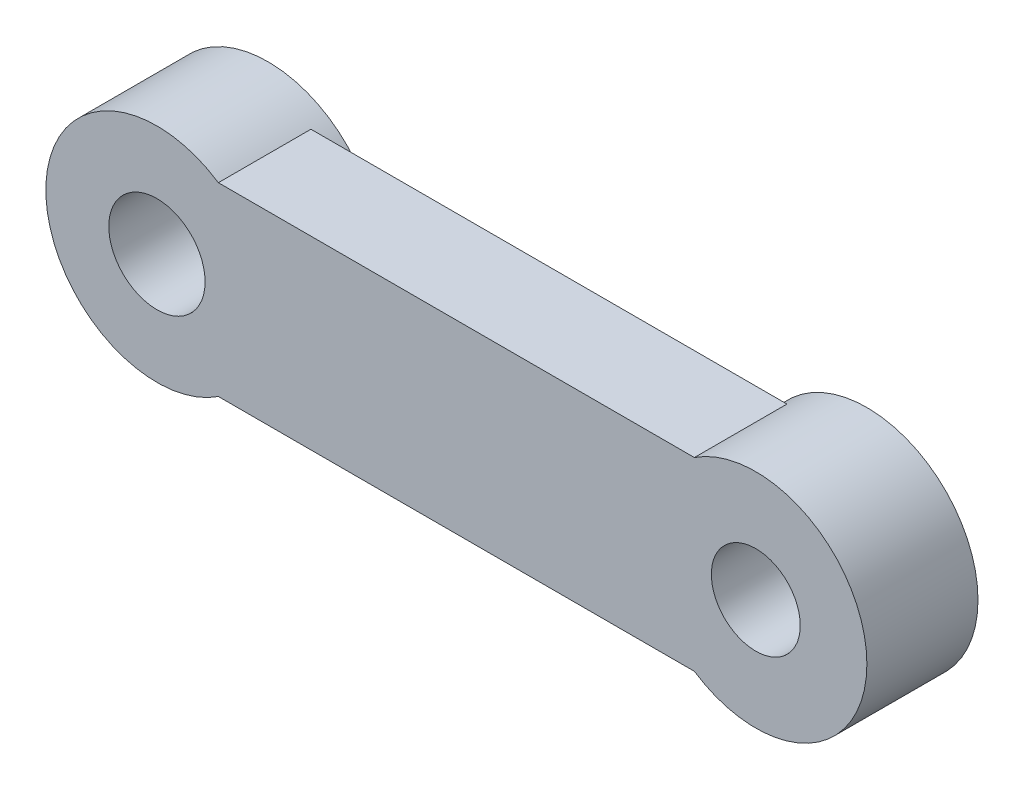
ISO-10303-21;
HEADER;
FILE_DESCRIPTION(('STEP AP214'),'2;1');
FILE_NAME('part.step','',(''),(''),'','','');
FILE_SCHEMA(('AUTOMOTIVE_DESIGN { 1 0 10303 214 1 1 1 1 }'));
ENDSEC;
DATA;
#1=APPLICATION_CONTEXT('core data for automotive mechanical design processes');
#2=APPLICATION_PROTOCOL_DEFINITION('international standard','automotive_design',2000,#1);
#3=PRODUCT_CONTEXT('',#1,'mechanical');
#4=PRODUCT('Part','Part','',(#3));
#5=PRODUCT_RELATED_PRODUCT_CATEGORY('part','',(#4));
#6=PRODUCT_DEFINITION_FORMATION('','',#4);
#7=PRODUCT_DEFINITION_CONTEXT('part definition',#1,'design');
#8=PRODUCT_DEFINITION('design','',#6,#7);
#9=PRODUCT_DEFINITION_SHAPE('','',#8);
#10=(LENGTH_UNIT() NAMED_UNIT(*) SI_UNIT(.MILLI.,.METRE.));
#11=(NAMED_UNIT(*) PLANE_ANGLE_UNIT() SI_UNIT($,.RADIAN.));
#12=(NAMED_UNIT(*) SI_UNIT($,.STERADIAN.) SOLID_ANGLE_UNIT());
#13=UNCERTAINTY_MEASURE_WITH_UNIT(LENGTH_MEASURE(1.E-05),#10,'distance_accuracy_value','');
#14=(GEOMETRIC_REPRESENTATION_CONTEXT(3) GLOBAL_UNCERTAINTY_ASSIGNED_CONTEXT((#13)) GLOBAL_UNIT_ASSIGNED_CONTEXT((#10,
#11,#12)) REPRESENTATION_CONTEXT('',''));
#15=CARTESIAN_POINT('',(0.,0.,0.));
#16=DIRECTION('',(0.,0.,1.));
#17=DIRECTION('',(1.,0.,0.));
#18=AXIS2_PLACEMENT_3D('',#15,#16,#17);
#19=CARTESIAN_POINT('',(0.,-2.5,2.5));
#20=DIRECTION('',(0.,1.,0.));
#21=DIRECTION('',(-1.,0.,0.));
#22=AXIS2_PLACEMENT_3D('',#19,#20,#21);
#23=PLANE('',#22);
#24=DIRECTION('',(1.,0.,0.));
#25=VECTOR('',#24,1.);
#26=CARTESIAN_POINT('',(0.,-2.5,2.5));
#27=LINE('',#26,#25);
#28=CARTESIAN_POINT('',(1.6583123951777,-2.5,2.5));
#29=VERTEX_POINT('',#28);
#30=CARTESIAN_POINT('',(14.5116876048223,-2.5,2.5));
#31=VERTEX_POINT('',#30);
#32=EDGE_CURVE('E101',#29,#31,#27,.T.);
#33=ORIENTED_EDGE('',*,*,#32,.F.);
#34=DIRECTION('',(0.,0.,1.));
#35=VECTOR('',#34,1.);
#36=CARTESIAN_POINT('',(1.6583123951777,-2.5,-0.5));
#37=LINE('',#36,#35);
#38=CARTESIAN_POINT('',(1.6583123951777,-2.5,0.));
#39=VERTEX_POINT('',#38);
#40=EDGE_CURVE('E80',#29,#39,#37,.F.);
#41=ORIENTED_EDGE('',*,*,#40,.T.);
#42=DIRECTION('',(1.,0.,0.));
#43=VECTOR('',#42,1.);
#44=CARTESIAN_POINT('',(0.,-2.5,0.));
#45=LINE('',#44,#43);
#46=CARTESIAN_POINT('',(14.5116876048223,-2.5,0.));
#47=VERTEX_POINT('',#46);
#48=EDGE_CURVE('E60',#39,#47,#45,.T.);
#49=ORIENTED_EDGE('',*,*,#48,.T.);
#50=DIRECTION('',(0.,0.,1.));
#51=VECTOR('',#50,1.);
#52=CARTESIAN_POINT('',(14.5116876048223,-2.5,-0.5));
#53=LINE('',#52,#51);
#54=EDGE_CURVE('E112',#47,#31,#53,.T.);
#55=ORIENTED_EDGE('',*,*,#54,.T.);
#56=EDGE_LOOP('',(#33,#41,#49,#55));
#57=FACE_BOUND('',#56,.T.);
#58=ADVANCED_FACE('F39',(#57),#23,.F.);
#59=CARTESIAN_POINT('',(0.,2.5,2.5));
#60=DIRECTION('',(0.,1.,0.));
#61=DIRECTION('',(0.,0.,1.));
#62=AXIS2_PLACEMENT_3D('',#59,#60,#61);
#63=PLANE('',#62);
#64=DIRECTION('',(0.,0.,1.));
#65=VECTOR('',#64,1.);
#66=CARTESIAN_POINT('',(1.6583123951777,2.5,-0.5));
#67=LINE('',#66,#65);
#68=CARTESIAN_POINT('',(1.6583123951777,2.5,2.5));
#69=VERTEX_POINT('',#68);
#70=CARTESIAN_POINT('',(1.6583123951777,2.5,0.));
#71=VERTEX_POINT('',#70);
#72=EDGE_CURVE('E53',#69,#71,#67,.F.);
#73=ORIENTED_EDGE('',*,*,#72,.F.);
#74=DIRECTION('',(1.,0.,0.));
#75=VECTOR('',#74,1.);
#76=CARTESIAN_POINT('',(0.,2.5,2.5));
#77=LINE('',#76,#75);
#78=CARTESIAN_POINT('',(14.5116876048223,2.5,2.5));
#79=VERTEX_POINT('',#78);
#80=EDGE_CURVE('E91',#69,#79,#77,.T.);
#81=ORIENTED_EDGE('',*,*,#80,.T.);
#82=DIRECTION('',(0.,0.,1.));
#83=VECTOR('',#82,1.);
#84=CARTESIAN_POINT('',(14.5116876048223,2.5,-0.5));
#85=LINE('',#84,#83);
#86=CARTESIAN_POINT('',(14.5116876048223,2.5,0.));
#87=VERTEX_POINT('',#86);
#88=EDGE_CURVE('E119',#87,#79,#85,.T.);
#89=ORIENTED_EDGE('',*,*,#88,.F.);
#90=DIRECTION('',(1.,0.,0.));
#91=VECTOR('',#90,1.);
#92=CARTESIAN_POINT('',(0.,2.5,0.));
#93=LINE('',#92,#91);
#94=EDGE_CURVE('E93',#71,#87,#93,.T.);
#95=ORIENTED_EDGE('',*,*,#94,.F.);
#96=EDGE_LOOP('',(#73,#81,#89,#95));
#97=FACE_BOUND('',#96,.T.);
#98=ADVANCED_FACE('F89',(#97),#63,.T.);
#99=CARTESIAN_POINT('',(0.,0.,2.5));
#100=DIRECTION('',(0.,0.,-1.));
#101=DIRECTION('',(-1.,0.,0.));
#102=AXIS2_PLACEMENT_3D('',#99,#100,#101);
#103=CYLINDRICAL_SURFACE('',#102,1.3);
#104=CARTESIAN_POINT('',(0.,0.,2.5));
#105=DIRECTION('',(0.,0.,1.));
#106=DIRECTION('',(1.,0.,0.));
#107=AXIS2_PLACEMENT_3D('',#104,#105,#106);
#108=CIRCLE('',#107,1.3);
#109=CARTESIAN_POINT('',(1.3,0.,2.5));
#110=VERTEX_POINT('',#109);
#111=EDGE_CURVE('E100',#110,#110,#108,.T.);
#112=ORIENTED_EDGE('',*,*,#111,.T.);
#113=EDGE_LOOP('',(#112));
#114=FACE_BOUND('',#113,.T.);
#115=CARTESIAN_POINT('',(0.,0.,-0.5));
#116=DIRECTION('',(0.,0.,1.));
#117=DIRECTION('',(1.,0.,0.));
#118=AXIS2_PLACEMENT_3D('',#115,#116,#117);
#119=CIRCLE('',#118,1.3);
#120=CARTESIAN_POINT('',(1.3,0.,-0.5));
#121=VERTEX_POINT('',#120);
#122=EDGE_CURVE('E84',#121,#121,#119,.T.);
#123=ORIENTED_EDGE('',*,*,#122,.F.);
#124=EDGE_LOOP('',(#123));
#125=FACE_BOUND('',#124,.T.);
#126=ADVANCED_FACE('F150',(#114,#125),#103,.F.);
#127=CARTESIAN_POINT('',(16.17,0.,2.5));
#128=DIRECTION('',(0.,0.,-1.));
#129=DIRECTION('',(-1.,0.,0.));
#130=AXIS2_PLACEMENT_3D('',#127,#128,#129);
#131=CYLINDRICAL_SURFACE('',#130,1.2);
#132=CARTESIAN_POINT('',(16.17,0.,2.5));
#133=DIRECTION('',(0.,0.,1.));
#134=DIRECTION('',(1.,0.,0.));
#135=AXIS2_PLACEMENT_3D('',#132,#133,#134);
#136=CIRCLE('',#135,1.2);
#137=CARTESIAN_POINT('',(17.37,0.,2.5));
#138=VERTEX_POINT('',#137);
#139=EDGE_CURVE('E104',#138,#138,#136,.T.);
#140=ORIENTED_EDGE('',*,*,#139,.T.);
#141=EDGE_LOOP('',(#140));
#142=FACE_BOUND('',#141,.T.);
#143=CARTESIAN_POINT('',(16.17,0.,-0.5));
#144=DIRECTION('',(0.,0.,1.));
#145=DIRECTION('',(1.,0.,0.));
#146=AXIS2_PLACEMENT_3D('',#143,#144,#145);
#147=CIRCLE('',#146,1.2);
#148=CARTESIAN_POINT('',(17.37,0.,-0.5));
#149=VERTEX_POINT('',#148);
#150=EDGE_CURVE('E125',#149,#149,#147,.T.);
#151=ORIENTED_EDGE('',*,*,#150,.F.);
#152=EDGE_LOOP('',(#151));
#153=FACE_BOUND('',#152,.T.);
#154=ADVANCED_FACE('F154',(#142,#153),#131,.F.);
#155=CARTESIAN_POINT('',(0.,0.,2.5));
#156=DIRECTION('',(0.,0.,1.));
#157=DIRECTION('',(1.,0.,0.));
#158=AXIS2_PLACEMENT_3D('',#155,#156,#157);
#159=PLANE('',#158);
#160=CARTESIAN_POINT('',(0.,0.,2.5));
#161=DIRECTION('',(0.,0.,1.));
#162=DIRECTION('',(1.,0.,0.));
#163=AXIS2_PLACEMENT_3D('',#160,#161,#162);
#164=CIRCLE('',#163,3.);
#165=EDGE_CURVE('E78',#69,#29,#164,.T.);
#166=ORIENTED_EDGE('',*,*,#165,.T.);
#167=ORIENTED_EDGE('',*,*,#32,.T.);
#168=CARTESIAN_POINT('',(16.17,0.,2.5));
#169=DIRECTION('',(0.,0.,1.));
#170=DIRECTION('',(1.,0.,0.));
#171=AXIS2_PLACEMENT_3D('',#168,#169,#170);
#172=CIRCLE('',#171,3.);
#173=EDGE_CURVE('E99',#31,#79,#172,.T.);
#174=ORIENTED_EDGE('',*,*,#173,.T.);
#175=ORIENTED_EDGE('',*,*,#80,.F.);
#176=EDGE_LOOP('',(#166,#167,#174,#175));
#177=FACE_BOUND('',#176,.T.);
#178=ORIENTED_EDGE('',*,*,#139,.F.);
#179=EDGE_LOOP('',(#178));
#180=FACE_BOUND('',#179,.T.);
#181=ORIENTED_EDGE('',*,*,#111,.F.);
#182=EDGE_LOOP('',(#181));
#183=FACE_BOUND('',#182,.T.);
#184=ADVANCED_FACE('F96',(#177,#180,#183),#159,.T.);
#185=CARTESIAN_POINT('',(0.,0.,0.));
#186=DIRECTION('',(0.,0.,1.));
#187=DIRECTION('',(1.,0.,0.));
#188=AXIS2_PLACEMENT_3D('',#185,#186,#187);
#189=PLANE('',#188);
#190=ORIENTED_EDGE('',*,*,#48,.F.);
#191=CARTESIAN_POINT('',(0.,0.,0.));
#192=DIRECTION('',(0.,0.,1.));
#193=DIRECTION('',(1.,0.,0.));
#194=AXIS2_PLACEMENT_3D('',#191,#192,#193);
#195=CIRCLE('',#194,3.);
#196=EDGE_CURVE('E11',#39,#71,#195,.T.);
#197=ORIENTED_EDGE('',*,*,#196,.T.);
#198=ORIENTED_EDGE('',*,*,#94,.T.);
#199=CARTESIAN_POINT('',(16.17,0.,0.));
#200=DIRECTION('',(0.,0.,1.));
#201=DIRECTION('',(1.,0.,0.));
#202=AXIS2_PLACEMENT_3D('',#199,#200,#201);
#203=CIRCLE('',#202,3.);
#204=EDGE_CURVE('E46',#87,#47,#203,.T.);
#205=ORIENTED_EDGE('',*,*,#204,.T.);
#206=EDGE_LOOP('',(#190,#197,#198,#205));
#207=FACE_BOUND('',#206,.T.);
#208=ADVANCED_FACE('F116',(#207),#189,.F.);
#209=CARTESIAN_POINT('',(16.17,0.,-0.5));
#210=DIRECTION('',(0.,0.,1.));
#211=DIRECTION('',(1.,0.,0.));
#212=AXIS2_PLACEMENT_3D('',#209,#210,#211);
#213=CYLINDRICAL_SURFACE('',#212,3.);
#214=CARTESIAN_POINT('',(16.17,0.,-0.5));
#215=DIRECTION('',(0.,0.,1.));
#216=DIRECTION('',(1.,0.,0.));
#217=AXIS2_PLACEMENT_3D('',#214,#215,#216);
#218=CIRCLE('',#217,3.);
#219=CARTESIAN_POINT('',(19.17,0.,-0.5));
#220=VERTEX_POINT('',#219);
#221=EDGE_CURVE('E120',#220,#220,#218,.T.);
#222=ORIENTED_EDGE('',*,*,#221,.T.);
#223=EDGE_LOOP('',(#222));
#224=FACE_BOUND('',#223,.T.);
#225=ORIENTED_EDGE('',*,*,#54,.F.);
#226=ORIENTED_EDGE('',*,*,#204,.F.);
#227=ORIENTED_EDGE('',*,*,#88,.T.);
#228=ORIENTED_EDGE('',*,*,#173,.F.);
#229=EDGE_LOOP('',(#225,#226,#227,#228));
#230=FACE_BOUND('',#229,.T.);
#231=ADVANCED_FACE('F118',(#224,#230),#213,.T.);
#232=CARTESIAN_POINT('',(16.17,0.,-0.5));
#233=DIRECTION('',(0.,0.,1.));
#234=DIRECTION('',(1.,0.,0.));
#235=AXIS2_PLACEMENT_3D('',#232,#233,#234);
#236=PLANE('',#235);
#237=ORIENTED_EDGE('',*,*,#150,.T.);
#238=EDGE_LOOP('',(#237));
#239=FACE_BOUND('',#238,.T.);
#240=ORIENTED_EDGE('',*,*,#221,.F.);
#241=EDGE_LOOP('',(#240));
#242=FACE_BOUND('',#241,.T.);
#243=ADVANCED_FACE('F143',(#239,#242),#236,.F.);
#244=CARTESIAN_POINT('',(0.,0.,-0.5));
#245=DIRECTION('',(0.,0.,1.));
#246=DIRECTION('',(1.,0.,0.));
#247=AXIS2_PLACEMENT_3D('',#244,#245,#246);
#248=CYLINDRICAL_SURFACE('',#247,3.);
#249=CARTESIAN_POINT('',(0.,0.,-0.5));
#250=DIRECTION('',(0.,0.,1.));
#251=DIRECTION('',(1.,0.,0.));
#252=AXIS2_PLACEMENT_3D('',#249,#250,#251);
#253=CIRCLE('',#252,3.);
#254=CARTESIAN_POINT('',(3.,0.,-0.5));
#255=VERTEX_POINT('',#254);
#256=EDGE_CURVE('E85',#255,#255,#253,.T.);
#257=ORIENTED_EDGE('',*,*,#256,.T.);
#258=EDGE_LOOP('',(#257));
#259=FACE_BOUND('',#258,.T.);
#260=ORIENTED_EDGE('',*,*,#40,.F.);
#261=ORIENTED_EDGE('',*,*,#165,.F.);
#262=ORIENTED_EDGE('',*,*,#72,.T.);
#263=ORIENTED_EDGE('',*,*,#196,.F.);
#264=EDGE_LOOP('',(#260,#261,#262,#263));
#265=FACE_BOUND('',#264,.T.);
#266=ADVANCED_FACE('F79',(#259,#265),#248,.T.);
#267=CARTESIAN_POINT('',(0.,0.,-0.5));
#268=DIRECTION('',(0.,0.,1.));
#269=DIRECTION('',(1.,0.,0.));
#270=AXIS2_PLACEMENT_3D('',#267,#268,#269);
#271=PLANE('',#270);
#272=ORIENTED_EDGE('',*,*,#122,.T.);
#273=EDGE_LOOP('',(#272));
#274=FACE_BOUND('',#273,.T.);
#275=ORIENTED_EDGE('',*,*,#256,.F.);
#276=EDGE_LOOP('',(#275));
#277=FACE_BOUND('',#276,.T.);
#278=ADVANCED_FACE('F136',(#274,#277),#271,.F.);
#279=CLOSED_SHELL('',(#58,#98,#126,#154,#184,#208,#231,#243,#266,#278));
#280=MANIFOLD_SOLID_BREP('B2',#279);
#281=ADVANCED_BREP_SHAPE_REPRESENTATION('',(#18,#280),#14);
#282=SHAPE_DEFINITION_REPRESENTATION(#9,#281);
ENDSEC;
END-ISO-10303-21;
